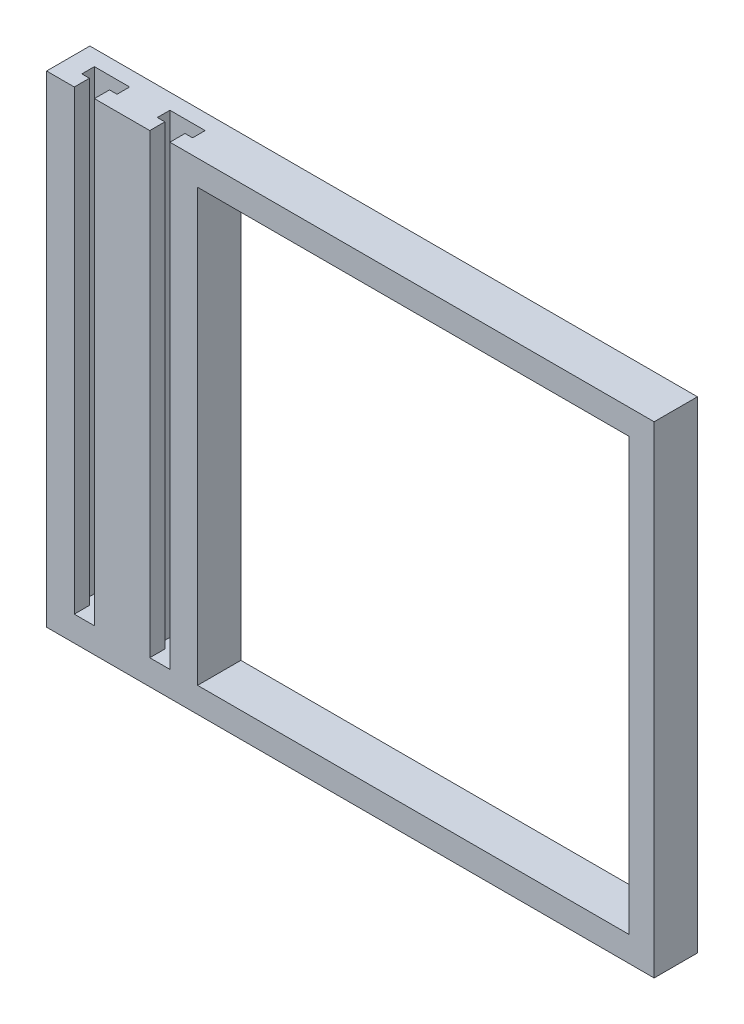
ISO-10303-21;
HEADER;
FILE_DESCRIPTION(('STEP AP214'),'2;1');
FILE_NAME('part.step','',(''),(''),'','','');
FILE_SCHEMA(('AUTOMOTIVE_DESIGN { 1 0 10303 214 1 1 1 1 }'));
ENDSEC;
DATA;
#1=APPLICATION_CONTEXT('core data for automotive mechanical design processes');
#2=APPLICATION_PROTOCOL_DEFINITION('international standard','automotive_design',2000,#1);
#3=PRODUCT_CONTEXT('',#1,'mechanical');
#4=PRODUCT('Part','Part','',(#3));
#5=PRODUCT_RELATED_PRODUCT_CATEGORY('part','',(#4));
#6=PRODUCT_DEFINITION_FORMATION('','',#4);
#7=PRODUCT_DEFINITION_CONTEXT('part definition',#1,'design');
#8=PRODUCT_DEFINITION('design','',#6,#7);
#9=PRODUCT_DEFINITION_SHAPE('','',#8);
#10=(LENGTH_UNIT() NAMED_UNIT(*) SI_UNIT(.MILLI.,.METRE.));
#11=(NAMED_UNIT(*) PLANE_ANGLE_UNIT() SI_UNIT($,.RADIAN.));
#12=(NAMED_UNIT(*) SI_UNIT($,.STERADIAN.) SOLID_ANGLE_UNIT());
#13=UNCERTAINTY_MEASURE_WITH_UNIT(LENGTH_MEASURE(1.E-05),#10,'distance_accuracy_value','');
#14=(GEOMETRIC_REPRESENTATION_CONTEXT(3) GLOBAL_UNCERTAINTY_ASSIGNED_CONTEXT((#13)) GLOBAL_UNIT_ASSIGNED_CONTEXT((#10,
#11,#12)) REPRESENTATION_CONTEXT('',''));
#15=CARTESIAN_POINT('',(0.,0.,0.));
#16=DIRECTION('',(0.,0.,1.));
#17=DIRECTION('',(1.,0.,0.));
#18=AXIS2_PLACEMENT_3D('',#15,#16,#17);
#19=CARTESIAN_POINT('',(0.,0.,8.6));
#20=DIRECTION('',(0.,0.,-1.));
#21=DIRECTION('',(-1.,0.,0.));
#22=AXIS2_PLACEMENT_3D('',#19,#20,#21);
#23=PLANE('',#22);
#24=DIRECTION('',(-1.,0.,0.));
#25=VECTOR('',#24,1.);
#26=CARTESIAN_POINT('',(-47.85,47.85,8.6));
#27=LINE('',#26,#25);
#28=CARTESIAN_POINT('',(-52.35,47.85,8.6));
#29=VERTEX_POINT('',#28);
#30=CARTESIAN_POINT('',(-63.35,47.85,8.6));
#31=VERTEX_POINT('',#30);
#32=EDGE_CURVE('E362',#29,#31,#27,.T.);
#33=ORIENTED_EDGE('',*,*,#32,.T.);
#34=DIRECTION('',(0.,1.,0.));
#35=VECTOR('',#34,1.);
#36=CARTESIAN_POINT('',(-63.35,-51.7522469073824,8.6));
#37=LINE('',#36,#35);
#38=CARTESIAN_POINT('',(-63.35,-42.85,8.6));
#39=VERTEX_POINT('',#38);
#40=EDGE_CURVE('E247',#39,#31,#37,.T.);
#41=ORIENTED_EDGE('',*,*,#40,.F.);
#42=DIRECTION('',(-1.,0.,0.));
#43=VECTOR('',#42,1.);
#44=CARTESIAN_POINT('',(-67.35,-42.85,8.6));
#45=LINE('',#44,#43);
#46=CARTESIAN_POINT('',(-67.35,-42.85,8.6));
#47=VERTEX_POINT('',#46);
#48=EDGE_CURVE('E401',#39,#47,#45,.T.);
#49=ORIENTED_EDGE('',*,*,#48,.T.);
#50=DIRECTION('',(0.,1.,0.));
#51=VECTOR('',#50,1.);
#52=CARTESIAN_POINT('',(-67.35,-51.7522469073824,8.6));
#53=LINE('',#52,#51);
#54=CARTESIAN_POINT('',(-67.35,47.85,8.6));
#55=VERTEX_POINT('',#54);
#56=EDGE_CURVE('E249',#47,#55,#53,.T.);
#57=ORIENTED_EDGE('',*,*,#56,.T.);
#58=CARTESIAN_POINT('',(-72.85,47.85,8.6));
#59=VERTEX_POINT('',#58);
#60=EDGE_CURVE('E358',#55,#59,#27,.T.);
#61=ORIENTED_EDGE('',*,*,#60,.T.);
#62=DIRECTION('',(0.,1.,0.));
#63=VECTOR('',#62,1.);
#64=CARTESIAN_POINT('',(-72.85,47.85,8.6));
#65=LINE('',#64,#63);
#66=CARTESIAN_POINT('',(-72.85,-47.85,8.6));
#67=VERTEX_POINT('',#66);
#68=EDGE_CURVE('E315',#67,#59,#65,.T.);
#69=ORIENTED_EDGE('',*,*,#68,.F.);
#70=DIRECTION('',(1.,0.,0.));
#71=VECTOR('',#70,1.);
#72=CARTESIAN_POINT('',(-47.85,-47.85,8.6));
#73=LINE('',#72,#71);
#74=CARTESIAN_POINT('',(47.85,-47.85,8.6));
#75=VERTEX_POINT('',#74);
#76=EDGE_CURVE('E353',#67,#75,#73,.T.);
#77=ORIENTED_EDGE('',*,*,#76,.T.);
#78=DIRECTION('',(0.,1.,0.));
#79=VECTOR('',#78,1.);
#80=CARTESIAN_POINT('',(47.85,-47.85,8.6));
#81=LINE('',#80,#79);
#82=CARTESIAN_POINT('',(47.85,47.85,8.6));
#83=VERTEX_POINT('',#82);
#84=EDGE_CURVE('E355',#75,#83,#81,.T.);
#85=ORIENTED_EDGE('',*,*,#84,.T.);
#86=CARTESIAN_POINT('',(-48.35,47.85,8.6));
#87=VERTEX_POINT('',#86);
#88=EDGE_CURVE('E359',#83,#87,#27,.T.);
#89=ORIENTED_EDGE('',*,*,#88,.T.);
#90=DIRECTION('',(0.,1.,0.));
#91=VECTOR('',#90,1.);
#92=CARTESIAN_POINT('',(-48.35,-51.7522469073824,8.6));
#93=LINE('',#92,#91);
#94=CARTESIAN_POINT('',(-48.35,-42.85,8.6));
#95=VERTEX_POINT('',#94);
#96=EDGE_CURVE('E303',#95,#87,#93,.T.);
#97=ORIENTED_EDGE('',*,*,#96,.F.);
#98=DIRECTION('',(-1.,0.,0.));
#99=VECTOR('',#98,1.);
#100=CARTESIAN_POINT('',(-48.35,-42.85,8.6));
#101=LINE('',#100,#99);
#102=CARTESIAN_POINT('',(-52.35,-42.85,8.6));
#103=VERTEX_POINT('',#102);
#104=EDGE_CURVE('E258',#95,#103,#101,.T.);
#105=ORIENTED_EDGE('',*,*,#104,.T.);
#106=DIRECTION('',(0.,1.,0.));
#107=VECTOR('',#106,1.);
#108=CARTESIAN_POINT('',(-52.35,-51.7522469073824,8.6));
#109=LINE('',#108,#107);
#110=EDGE_CURVE('E305',#103,#29,#109,.T.);
#111=ORIENTED_EDGE('',*,*,#110,.T.);
#112=EDGE_LOOP('',(#33,#41,#49,#57,#61,#69,#77,#85,#89,#97,#105,#111));
#113=FACE_BOUND('',#112,.T.);
#114=DIRECTION('',(0.,1.,0.));
#115=VECTOR('',#114,1.);
#116=CARTESIAN_POINT('',(42.85,-42.85,8.6));
#117=LINE('',#116,#115);
#118=CARTESIAN_POINT('',(42.85,-42.85,8.6));
#119=VERTEX_POINT('',#118);
#120=CARTESIAN_POINT('',(42.85,42.85,8.6));
#121=VERTEX_POINT('',#120);
#122=EDGE_CURVE('E322',#119,#121,#117,.T.);
#123=ORIENTED_EDGE('',*,*,#122,.F.);
#124=DIRECTION('',(1.,0.,0.));
#125=VECTOR('',#124,1.);
#126=CARTESIAN_POINT('',(-42.85,-42.85,8.6));
#127=LINE('',#126,#125);
#128=CARTESIAN_POINT('',(-42.85,-42.85,8.6));
#129=VERTEX_POINT('',#128);
#130=EDGE_CURVE('E330',#129,#119,#127,.T.);
#131=ORIENTED_EDGE('',*,*,#130,.F.);
#132=DIRECTION('',(0.,-1.,0.));
#133=VECTOR('',#132,1.);
#134=CARTESIAN_POINT('',(-42.85,-42.85,8.6));
#135=LINE('',#134,#133);
#136=CARTESIAN_POINT('',(-42.85,42.85,8.6));
#137=VERTEX_POINT('',#136);
#138=EDGE_CURVE('E327',#137,#129,#135,.T.);
#139=ORIENTED_EDGE('',*,*,#138,.F.);
#140=DIRECTION('',(-1.,0.,0.));
#141=VECTOR('',#140,1.);
#142=CARTESIAN_POINT('',(-42.85,42.85,8.6));
#143=LINE('',#142,#141);
#144=EDGE_CURVE('E324',#121,#137,#143,.T.);
#145=ORIENTED_EDGE('',*,*,#144,.F.);
#146=EDGE_LOOP('',(#123,#131,#139,#145));
#147=FACE_BOUND('',#146,.T.);
#148=ADVANCED_FACE('F42',(#113,#147),#23,.F.);
#149=CARTESIAN_POINT('',(0.,0.,0.));
#150=DIRECTION('',(0.,0.,-1.));
#151=DIRECTION('',(-1.,0.,0.));
#152=AXIS2_PLACEMENT_3D('',#149,#150,#151);
#153=PLANE('',#152);
#154=DIRECTION('',(1.,0.,0.));
#155=VECTOR('',#154,1.);
#156=CARTESIAN_POINT('',(-47.85,-47.85,0.));
#157=LINE('',#156,#155);
#158=CARTESIAN_POINT('',(-72.85,-47.85,0.));
#159=VERTEX_POINT('',#158);
#160=CARTESIAN_POINT('',(47.85,-47.85,0.));
#161=VERTEX_POINT('',#160);
#162=EDGE_CURVE('E352',#159,#161,#157,.T.);
#163=ORIENTED_EDGE('',*,*,#162,.F.);
#164=DIRECTION('',(0.,-1.,0.));
#165=VECTOR('',#164,1.);
#166=CARTESIAN_POINT('',(-72.85,47.85,0.));
#167=LINE('',#166,#165);
#168=CARTESIAN_POINT('',(-72.85,47.85,0.));
#169=VERTEX_POINT('',#168);
#170=EDGE_CURVE('E256',#169,#159,#167,.T.);
#171=ORIENTED_EDGE('',*,*,#170,.F.);
#172=DIRECTION('',(-1.,0.,0.));
#173=VECTOR('',#172,1.);
#174=CARTESIAN_POINT('',(-47.85,47.85,0.));
#175=LINE('',#174,#173);
#176=CARTESIAN_POINT('',(47.85,47.85,0.));
#177=VERTEX_POINT('',#176);
#178=EDGE_CURVE('E356',#177,#169,#175,.T.);
#179=ORIENTED_EDGE('',*,*,#178,.F.);
#180=DIRECTION('',(0.,1.,0.));
#181=VECTOR('',#180,1.);
#182=CARTESIAN_POINT('',(47.85,-47.85,0.));
#183=LINE('',#182,#181);
#184=EDGE_CURVE('E364',#161,#177,#183,.T.);
#185=ORIENTED_EDGE('',*,*,#184,.F.);
#186=EDGE_LOOP('',(#163,#171,#179,#185));
#187=FACE_BOUND('',#186,.T.);
#188=DIRECTION('',(1.,0.,0.));
#189=VECTOR('',#188,1.);
#190=CARTESIAN_POINT('',(-42.85,-42.85,0.));
#191=LINE('',#190,#189);
#192=CARTESIAN_POINT('',(-42.85,-42.85,0.));
#193=VERTEX_POINT('',#192);
#194=CARTESIAN_POINT('',(42.85,-42.85,0.));
#195=VERTEX_POINT('',#194);
#196=EDGE_CURVE('E325',#193,#195,#191,.T.);
#197=ORIENTED_EDGE('',*,*,#196,.T.);
#198=DIRECTION('',(0.,1.,0.));
#199=VECTOR('',#198,1.);
#200=CARTESIAN_POINT('',(42.85,-42.85,0.));
#201=LINE('',#200,#199);
#202=CARTESIAN_POINT('',(42.85,42.85,0.));
#203=VERTEX_POINT('',#202);
#204=EDGE_CURVE('E321',#195,#203,#201,.T.);
#205=ORIENTED_EDGE('',*,*,#204,.T.);
#206=DIRECTION('',(-1.,0.,0.));
#207=VECTOR('',#206,1.);
#208=CARTESIAN_POINT('',(-42.85,42.85,0.));
#209=LINE('',#208,#207);
#210=CARTESIAN_POINT('',(-42.85,42.85,0.));
#211=VERTEX_POINT('',#210);
#212=EDGE_CURVE('E335',#203,#211,#209,.T.);
#213=ORIENTED_EDGE('',*,*,#212,.T.);
#214=DIRECTION('',(0.,-1.,0.));
#215=VECTOR('',#214,1.);
#216=CARTESIAN_POINT('',(-42.85,-42.85,0.));
#217=LINE('',#216,#215);
#218=EDGE_CURVE('E338',#211,#193,#217,.T.);
#219=ORIENTED_EDGE('',*,*,#218,.T.);
#220=EDGE_LOOP('',(#197,#205,#213,#219));
#221=FACE_BOUND('',#220,.T.);
#222=ADVANCED_FACE('F377',(#187,#221),#153,.T.);
#223=CARTESIAN_POINT('',(-47.85,-47.85,8.6));
#224=DIRECTION('',(0.,1.,0.));
#225=DIRECTION('',(0.,0.,1.));
#226=AXIS2_PLACEMENT_3D('',#223,#224,#225);
#227=PLANE('',#226);
#228=ORIENTED_EDGE('',*,*,#162,.T.);
#229=DIRECTION('',(0.,0.,-1.));
#230=VECTOR('',#229,1.);
#231=CARTESIAN_POINT('',(47.85,-47.85,8.6));
#232=LINE('',#231,#230);
#233=EDGE_CURVE('E11',#75,#161,#232,.T.);
#234=ORIENTED_EDGE('',*,*,#233,.F.);
#235=ORIENTED_EDGE('',*,*,#76,.F.);
#236=DIRECTION('',(0.,0.,1.));
#237=VECTOR('',#236,1.);
#238=CARTESIAN_POINT('',(-72.85,-47.85,0.));
#239=LINE('',#238,#237);
#240=EDGE_CURVE('E312',#159,#67,#239,.T.);
#241=ORIENTED_EDGE('',*,*,#240,.F.);
#242=EDGE_LOOP('',(#228,#234,#235,#241));
#243=FACE_BOUND('',#242,.T.);
#244=ADVANCED_FACE('F44',(#243),#227,.F.);
#245=CARTESIAN_POINT('',(47.85,-47.85,8.6));
#246=DIRECTION('',(-1.,0.,0.));
#247=DIRECTION('',(0.,-1.,0.));
#248=AXIS2_PLACEMENT_3D('',#245,#246,#247);
#249=PLANE('',#248);
#250=ORIENTED_EDGE('',*,*,#184,.T.);
#251=DIRECTION('',(0.,0.,-1.));
#252=VECTOR('',#251,1.);
#253=CARTESIAN_POINT('',(47.85,47.85,8.6));
#254=LINE('',#253,#252);
#255=EDGE_CURVE('E50',#83,#177,#254,.T.);
#256=ORIENTED_EDGE('',*,*,#255,.F.);
#257=ORIENTED_EDGE('',*,*,#84,.F.);
#258=ORIENTED_EDGE('',*,*,#233,.T.);
#259=EDGE_LOOP('',(#250,#256,#257,#258));
#260=FACE_BOUND('',#259,.T.);
#261=ADVANCED_FACE('F443',(#260),#249,.F.);
#262=CARTESIAN_POINT('',(-47.85,47.85,8.6));
#263=DIRECTION('',(0.,-1.,0.));
#264=DIRECTION('',(1.,0.,0.));
#265=AXIS2_PLACEMENT_3D('',#262,#263,#264);
#266=PLANE('',#265);
#267=DIRECTION('',(1.,0.,0.));
#268=VECTOR('',#267,1.);
#269=CARTESIAN_POINT('',(-63.35,47.85,5.6));
#270=LINE('',#269,#268);
#271=CARTESIAN_POINT('',(-63.35,47.85,5.6));
#272=VERTEX_POINT('',#271);
#273=CARTESIAN_POINT('',(-61.85,47.85,5.6));
#274=VERTEX_POINT('',#273);
#275=EDGE_CURVE('E235',#272,#274,#270,.T.);
#276=ORIENTED_EDGE('',*,*,#275,.F.);
#277=DIRECTION('',(0.,0.,-1.));
#278=VECTOR('',#277,1.);
#279=CARTESIAN_POINT('',(-63.35,47.85,8.6));
#280=LINE('',#279,#278);
#281=EDGE_CURVE('E229',#31,#272,#280,.T.);
#282=ORIENTED_EDGE('',*,*,#281,.F.);
#283=ORIENTED_EDGE('',*,*,#32,.F.);
#284=DIRECTION('',(0.,0.,1.));
#285=VECTOR('',#284,1.);
#286=CARTESIAN_POINT('',(-52.35,47.85,8.6));
#287=LINE('',#286,#285);
#288=CARTESIAN_POINT('',(-52.35,47.85,5.6));
#289=VERTEX_POINT('',#288);
#290=EDGE_CURVE('E276',#289,#29,#287,.T.);
#291=ORIENTED_EDGE('',*,*,#290,.F.);
#292=DIRECTION('',(1.,0.,0.));
#293=VECTOR('',#292,1.);
#294=CARTESIAN_POINT('',(-52.35,47.85,5.6));
#295=LINE('',#294,#293);
#296=CARTESIAN_POINT('',(-53.85,47.85,5.6));
#297=VERTEX_POINT('',#296);
#298=EDGE_CURVE('E65',#297,#289,#295,.T.);
#299=ORIENTED_EDGE('',*,*,#298,.F.);
#300=DIRECTION('',(0.,0.,1.));
#301=VECTOR('',#300,1.);
#302=CARTESIAN_POINT('',(-53.85,47.85,5.6));
#303=LINE('',#302,#301);
#304=CARTESIAN_POINT('',(-53.85,47.85,3.1));
#305=VERTEX_POINT('',#304);
#306=EDGE_CURVE('E290',#305,#297,#303,.T.);
#307=ORIENTED_EDGE('',*,*,#306,.F.);
#308=DIRECTION('',(-1.,0.,0.));
#309=VECTOR('',#308,1.);
#310=CARTESIAN_POINT('',(-53.85,47.85,3.1));
#311=LINE('',#310,#309);
#312=CARTESIAN_POINT('',(-46.85,47.85,3.1));
#313=VERTEX_POINT('',#312);
#314=EDGE_CURVE('E287',#313,#305,#311,.T.);
#315=ORIENTED_EDGE('',*,*,#314,.F.);
#316=DIRECTION('',(0.,0.,-1.));
#317=VECTOR('',#316,1.);
#318=CARTESIAN_POINT('',(-46.85,47.85,5.6));
#319=LINE('',#318,#317);
#320=CARTESIAN_POINT('',(-46.85,47.85,5.6));
#321=VERTEX_POINT('',#320);
#322=EDGE_CURVE('E284',#321,#313,#319,.T.);
#323=ORIENTED_EDGE('',*,*,#322,.F.);
#324=DIRECTION('',(1.,0.,0.));
#325=VECTOR('',#324,1.);
#326=CARTESIAN_POINT('',(-48.35,47.85,5.6));
#327=LINE('',#326,#325);
#328=CARTESIAN_POINT('',(-48.35,47.85,5.6));
#329=VERTEX_POINT('',#328);
#330=EDGE_CURVE('E281',#329,#321,#327,.T.);
#331=ORIENTED_EDGE('',*,*,#330,.F.);
#332=DIRECTION('',(0.,0.,-1.));
#333=VECTOR('',#332,1.);
#334=CARTESIAN_POINT('',(-48.35,47.85,8.6));
#335=LINE('',#334,#333);
#336=EDGE_CURVE('E278',#87,#329,#335,.T.);
#337=ORIENTED_EDGE('',*,*,#336,.F.);
#338=ORIENTED_EDGE('',*,*,#88,.F.);
#339=ORIENTED_EDGE('',*,*,#255,.T.);
#340=ORIENTED_EDGE('',*,*,#178,.T.);
#341=DIRECTION('',(0.,0.,-1.));
#342=VECTOR('',#341,1.);
#343=CARTESIAN_POINT('',(-72.85,47.85,0.));
#344=LINE('',#343,#342);
#345=EDGE_CURVE('E318',#59,#169,#344,.T.);
#346=ORIENTED_EDGE('',*,*,#345,.F.);
#347=ORIENTED_EDGE('',*,*,#60,.F.);
#348=DIRECTION('',(0.,0.,1.));
#349=VECTOR('',#348,1.);
#350=CARTESIAN_POINT('',(-67.35,47.85,8.6));
#351=LINE('',#350,#349);
#352=CARTESIAN_POINT('',(-67.35,47.85,5.6));
#353=VERTEX_POINT('',#352);
#354=EDGE_CURVE('E227',#353,#55,#351,.T.);
#355=ORIENTED_EDGE('',*,*,#354,.F.);
#356=DIRECTION('',(1.,0.,0.));
#357=VECTOR('',#356,1.);
#358=CARTESIAN_POINT('',(-67.35,47.85,5.6));
#359=LINE('',#358,#357);
#360=CARTESIAN_POINT('',(-68.85,47.85,5.6));
#361=VERTEX_POINT('',#360);
#362=EDGE_CURVE('E210',#361,#353,#359,.T.);
#363=ORIENTED_EDGE('',*,*,#362,.F.);
#364=DIRECTION('',(0.,0.,1.));
#365=VECTOR('',#364,1.);
#366=CARTESIAN_POINT('',(-68.85,47.85,5.6));
#367=LINE('',#366,#365);
#368=CARTESIAN_POINT('',(-68.85,47.85,3.1));
#369=VERTEX_POINT('',#368);
#370=EDGE_CURVE('E220',#369,#361,#367,.T.);
#371=ORIENTED_EDGE('',*,*,#370,.F.);
#372=DIRECTION('',(-1.,0.,0.));
#373=VECTOR('',#372,1.);
#374=CARTESIAN_POINT('',(-61.85,47.85,3.1));
#375=LINE('',#374,#373);
#376=CARTESIAN_POINT('',(-61.85,47.85,3.1));
#377=VERTEX_POINT('',#376);
#378=EDGE_CURVE('E57',#377,#369,#375,.T.);
#379=ORIENTED_EDGE('',*,*,#378,.F.);
#380=DIRECTION('',(0.,0.,-1.));
#381=VECTOR('',#380,1.);
#382=CARTESIAN_POINT('',(-61.85,47.85,5.6));
#383=LINE('',#382,#381);
#384=EDGE_CURVE('E238',#274,#377,#383,.T.);
#385=ORIENTED_EDGE('',*,*,#384,.F.);
#386=EDGE_LOOP('',(#276,#282,#283,#291,#299,#307,#315,#323,#331,#337,#338,#339,#340,#346,#347,
#355,#363,#371,#379,#385));
#387=FACE_BOUND('',#386,.T.);
#388=ADVANCED_FACE('F225',(#387),#266,.F.);
#389=CARTESIAN_POINT('',(42.85,-42.85,8.6));
#390=DIRECTION('',(-1.,0.,0.));
#391=DIRECTION('',(0.,0.,1.));
#392=AXIS2_PLACEMENT_3D('',#389,#390,#391);
#393=PLANE('',#392);
#394=ORIENTED_EDGE('',*,*,#204,.F.);
#395=DIRECTION('',(0.,0.,-1.));
#396=VECTOR('',#395,1.);
#397=CARTESIAN_POINT('',(42.85,-42.85,8.6));
#398=LINE('',#397,#396);
#399=EDGE_CURVE('E332',#119,#195,#398,.T.);
#400=ORIENTED_EDGE('',*,*,#399,.F.);
#401=ORIENTED_EDGE('',*,*,#122,.T.);
#402=DIRECTION('',(0.,0.,-1.));
#403=VECTOR('',#402,1.);
#404=CARTESIAN_POINT('',(42.85,42.85,8.6));
#405=LINE('',#404,#403);
#406=EDGE_CURVE('E349',#121,#203,#405,.T.);
#407=ORIENTED_EDGE('',*,*,#406,.T.);
#408=EDGE_LOOP('',(#394,#400,#401,#407));
#409=FACE_BOUND('',#408,.T.);
#410=ADVANCED_FACE('F440',(#409),#393,.T.);
#411=CARTESIAN_POINT('',(-42.85,42.85,8.6));
#412=DIRECTION('',(0.,-1.,0.));
#413=DIRECTION('',(0.,0.,-1.));
#414=AXIS2_PLACEMENT_3D('',#411,#412,#413);
#415=PLANE('',#414);
#416=ORIENTED_EDGE('',*,*,#212,.F.);
#417=ORIENTED_EDGE('',*,*,#406,.F.);
#418=ORIENTED_EDGE('',*,*,#144,.T.);
#419=DIRECTION('',(0.,0.,-1.));
#420=VECTOR('',#419,1.);
#421=CARTESIAN_POINT('',(-42.85,42.85,8.6));
#422=LINE('',#421,#420);
#423=EDGE_CURVE('E347',#137,#211,#422,.T.);
#424=ORIENTED_EDGE('',*,*,#423,.T.);
#425=EDGE_LOOP('',(#416,#417,#418,#424));
#426=FACE_BOUND('',#425,.T.);
#427=ADVANCED_FACE('F508',(#426),#415,.T.);
#428=CARTESIAN_POINT('',(-42.85,-42.85,8.6));
#429=DIRECTION('',(1.,0.,0.));
#430=DIRECTION('',(0.,0.,-1.));
#431=AXIS2_PLACEMENT_3D('',#428,#429,#430);
#432=PLANE('',#431);
#433=ORIENTED_EDGE('',*,*,#218,.F.);
#434=ORIENTED_EDGE('',*,*,#423,.F.);
#435=ORIENTED_EDGE('',*,*,#138,.T.);
#436=DIRECTION('',(0.,0.,-1.));
#437=VECTOR('',#436,1.);
#438=CARTESIAN_POINT('',(-42.85,-42.85,8.6));
#439=LINE('',#438,#437);
#440=EDGE_CURVE('E345',#129,#193,#439,.T.);
#441=ORIENTED_EDGE('',*,*,#440,.T.);
#442=EDGE_LOOP('',(#433,#434,#435,#441));
#443=FACE_BOUND('',#442,.T.);
#444=ADVANCED_FACE('F505',(#443),#432,.T.);
#445=CARTESIAN_POINT('',(-42.85,-42.85,8.6));
#446=DIRECTION('',(0.,1.,0.));
#447=DIRECTION('',(0.,0.,1.));
#448=AXIS2_PLACEMENT_3D('',#445,#446,#447);
#449=PLANE('',#448);
#450=ORIENTED_EDGE('',*,*,#196,.F.);
#451=ORIENTED_EDGE('',*,*,#440,.F.);
#452=ORIENTED_EDGE('',*,*,#130,.T.);
#453=ORIENTED_EDGE('',*,*,#399,.T.);
#454=EDGE_LOOP('',(#450,#451,#452,#453));
#455=FACE_BOUND('',#454,.T.);
#456=ADVANCED_FACE('F502',(#455),#449,.T.);
#457=CARTESIAN_POINT('',(-72.85,0.,0.));
#458=DIRECTION('',(-1.,0.,0.));
#459=DIRECTION('',(0.,0.,1.));
#460=AXIS2_PLACEMENT_3D('',#457,#458,#459);
#461=PLANE('',#460);
#462=ORIENTED_EDGE('',*,*,#170,.T.);
#463=ORIENTED_EDGE('',*,*,#240,.T.);
#464=ORIENTED_EDGE('',*,*,#68,.T.);
#465=ORIENTED_EDGE('',*,*,#345,.T.);
#466=EDGE_LOOP('',(#462,#463,#464,#465));
#467=FACE_BOUND('',#466,.T.);
#468=ADVANCED_FACE('F381',(#467),#461,.T.);
#469=CARTESIAN_POINT('',(-52.35,-51.7522469073824,5.6));
#470=DIRECTION('',(0.,0.,1.));
#471=DIRECTION('',(1.,0.,0.));
#472=AXIS2_PLACEMENT_3D('',#469,#470,#471);
#473=PLANE('',#472);
#474=DIRECTION('',(-1.,0.,0.));
#475=VECTOR('',#474,1.);
#476=CARTESIAN_POINT('',(-52.35,-42.85,5.6));
#477=LINE('',#476,#475);
#478=CARTESIAN_POINT('',(-52.35,-42.85,5.6));
#479=VERTEX_POINT('',#478);
#480=CARTESIAN_POINT('',(-53.85,-42.85,5.6));
#481=VERTEX_POINT('',#480);
#482=EDGE_CURVE('E272',#479,#481,#477,.T.);
#483=ORIENTED_EDGE('',*,*,#482,.T.);
#484=DIRECTION('',(0.,1.,0.));
#485=VECTOR('',#484,1.);
#486=CARTESIAN_POINT('',(-53.85,-51.7522469073824,5.6));
#487=LINE('',#486,#485);
#488=EDGE_CURVE('E262',#481,#297,#487,.T.);
#489=ORIENTED_EDGE('',*,*,#488,.T.);
#490=ORIENTED_EDGE('',*,*,#298,.T.);
#491=DIRECTION('',(0.,1.,0.));
#492=VECTOR('',#491,1.);
#493=CARTESIAN_POINT('',(-52.35,-51.7522469073824,5.6));
#494=LINE('',#493,#492);
#495=EDGE_CURVE('E293',#479,#289,#494,.T.);
#496=ORIENTED_EDGE('',*,*,#495,.F.);
#497=EDGE_LOOP('',(#483,#489,#490,#496));
#498=FACE_BOUND('',#497,.T.);
#499=ADVANCED_FACE('F472',(#498),#473,.F.);
#500=CARTESIAN_POINT('',(-53.85,-51.7522469073824,5.6));
#501=DIRECTION('',(-1.,0.,0.));
#502=DIRECTION('',(0.,0.,1.));
#503=AXIS2_PLACEMENT_3D('',#500,#501,#502);
#504=PLANE('',#503);
#505=DIRECTION('',(0.,0.,-1.));
#506=VECTOR('',#505,1.);
#507=CARTESIAN_POINT('',(-53.85,-42.85,5.6));
#508=LINE('',#507,#506);
#509=CARTESIAN_POINT('',(-53.85,-42.85,3.1));
#510=VERTEX_POINT('',#509);
#511=EDGE_CURVE('E270',#481,#510,#508,.T.);
#512=ORIENTED_EDGE('',*,*,#511,.T.);
#513=DIRECTION('',(0.,1.,0.));
#514=VECTOR('',#513,1.);
#515=CARTESIAN_POINT('',(-53.85,-51.7522469073824,3.1));
#516=LINE('',#515,#514);
#517=EDGE_CURVE('E295',#510,#305,#516,.T.);
#518=ORIENTED_EDGE('',*,*,#517,.T.);
#519=ORIENTED_EDGE('',*,*,#306,.T.);
#520=ORIENTED_EDGE('',*,*,#488,.F.);
#521=EDGE_LOOP('',(#512,#518,#519,#520));
#522=FACE_BOUND('',#521,.T.);
#523=ADVANCED_FACE('F477',(#522),#504,.F.);
#524=CARTESIAN_POINT('',(-53.85,-51.7522469073824,3.1));
#525=DIRECTION('',(0.,0.,-1.));
#526=DIRECTION('',(-1.,0.,0.));
#527=AXIS2_PLACEMENT_3D('',#524,#525,#526);
#528=PLANE('',#527);
#529=DIRECTION('',(1.,0.,0.));
#530=VECTOR('',#529,1.);
#531=CARTESIAN_POINT('',(-53.85,-42.85,3.1));
#532=LINE('',#531,#530);
#533=CARTESIAN_POINT('',(-46.85,-42.85,3.1));
#534=VERTEX_POINT('',#533);
#535=EDGE_CURVE('E268',#510,#534,#532,.T.);
#536=ORIENTED_EDGE('',*,*,#535,.T.);
#537=DIRECTION('',(0.,1.,0.));
#538=VECTOR('',#537,1.);
#539=CARTESIAN_POINT('',(-46.85,-51.7522469073824,3.1));
#540=LINE('',#539,#538);
#541=EDGE_CURVE('E297',#534,#313,#540,.T.);
#542=ORIENTED_EDGE('',*,*,#541,.T.);
#543=ORIENTED_EDGE('',*,*,#314,.T.);
#544=ORIENTED_EDGE('',*,*,#517,.F.);
#545=EDGE_LOOP('',(#536,#542,#543,#544));
#546=FACE_BOUND('',#545,.T.);
#547=ADVANCED_FACE('F480',(#546),#528,.F.);
#548=CARTESIAN_POINT('',(-46.85,-51.7522469073824,5.6));
#549=DIRECTION('',(1.,0.,0.));
#550=DIRECTION('',(0.,0.,-1.));
#551=AXIS2_PLACEMENT_3D('',#548,#549,#550);
#552=PLANE('',#551);
#553=DIRECTION('',(0.,0.,1.));
#554=VECTOR('',#553,1.);
#555=CARTESIAN_POINT('',(-46.85,-42.85,5.6));
#556=LINE('',#555,#554);
#557=CARTESIAN_POINT('',(-46.85,-42.85,5.6));
#558=VERTEX_POINT('',#557);
#559=EDGE_CURVE('E266',#534,#558,#556,.T.);
#560=ORIENTED_EDGE('',*,*,#559,.T.);
#561=DIRECTION('',(0.,1.,0.));
#562=VECTOR('',#561,1.);
#563=CARTESIAN_POINT('',(-46.85,-51.7522469073824,5.6));
#564=LINE('',#563,#562);
#565=EDGE_CURVE('E299',#558,#321,#564,.T.);
#566=ORIENTED_EDGE('',*,*,#565,.T.);
#567=ORIENTED_EDGE('',*,*,#322,.T.);
#568=ORIENTED_EDGE('',*,*,#541,.F.);
#569=EDGE_LOOP('',(#560,#566,#567,#568));
#570=FACE_BOUND('',#569,.T.);
#571=ADVANCED_FACE('F483',(#570),#552,.F.);
#572=CARTESIAN_POINT('',(-48.35,-51.7522469073824,5.6));
#573=DIRECTION('',(0.,0.,1.));
#574=DIRECTION('',(1.,0.,0.));
#575=AXIS2_PLACEMENT_3D('',#572,#573,#574);
#576=PLANE('',#575);
#577=DIRECTION('',(-1.,0.,0.));
#578=VECTOR('',#577,1.);
#579=CARTESIAN_POINT('',(-48.35,-42.85,5.6));
#580=LINE('',#579,#578);
#581=CARTESIAN_POINT('',(-48.35,-42.85,5.6));
#582=VERTEX_POINT('',#581);
#583=EDGE_CURVE('E264',#558,#582,#580,.T.);
#584=ORIENTED_EDGE('',*,*,#583,.T.);
#585=DIRECTION('',(0.,1.,0.));
#586=VECTOR('',#585,1.);
#587=CARTESIAN_POINT('',(-48.35,-51.7522469073824,5.6));
#588=LINE('',#587,#586);
#589=EDGE_CURVE('E301',#582,#329,#588,.T.);
#590=ORIENTED_EDGE('',*,*,#589,.T.);
#591=ORIENTED_EDGE('',*,*,#330,.T.);
#592=ORIENTED_EDGE('',*,*,#565,.F.);
#593=EDGE_LOOP('',(#584,#590,#591,#592));
#594=FACE_BOUND('',#593,.T.);
#595=ADVANCED_FACE('F462',(#594),#576,.F.);
#596=CARTESIAN_POINT('',(-48.35,-51.7522469073824,8.6));
#597=DIRECTION('',(1.,0.,0.));
#598=DIRECTION('',(0.,0.,-1.));
#599=AXIS2_PLACEMENT_3D('',#596,#597,#598);
#600=PLANE('',#599);
#601=DIRECTION('',(0.,0.,1.));
#602=VECTOR('',#601,1.);
#603=CARTESIAN_POINT('',(-48.35,-42.85,8.6));
#604=LINE('',#603,#602);
#605=EDGE_CURVE('E261',#582,#95,#604,.T.);
#606=ORIENTED_EDGE('',*,*,#605,.T.);
#607=ORIENTED_EDGE('',*,*,#96,.T.);
#608=ORIENTED_EDGE('',*,*,#336,.T.);
#609=ORIENTED_EDGE('',*,*,#589,.F.);
#610=EDGE_LOOP('',(#606,#607,#608,#609));
#611=FACE_BOUND('',#610,.T.);
#612=ADVANCED_FACE('F454',(#611),#600,.F.);
#613=CARTESIAN_POINT('',(-52.35,-51.7522469073824,8.6));
#614=DIRECTION('',(-1.,0.,0.));
#615=DIRECTION('',(0.,0.,1.));
#616=AXIS2_PLACEMENT_3D('',#613,#614,#615);
#617=PLANE('',#616);
#618=DIRECTION('',(0.,0.,-1.));
#619=VECTOR('',#618,1.);
#620=CARTESIAN_POINT('',(-52.35,-42.85,8.6));
#621=LINE('',#620,#619);
#622=EDGE_CURVE('E274',#103,#479,#621,.T.);
#623=ORIENTED_EDGE('',*,*,#622,.T.);
#624=ORIENTED_EDGE('',*,*,#495,.T.);
#625=ORIENTED_EDGE('',*,*,#290,.T.);
#626=ORIENTED_EDGE('',*,*,#110,.F.);
#627=EDGE_LOOP('',(#623,#624,#625,#626));
#628=FACE_BOUND('',#627,.T.);
#629=ADVANCED_FACE('F471',(#628),#617,.F.);
#630=CARTESIAN_POINT('',(-42.85,-42.85,8.6));
#631=DIRECTION('',(0.,1.,0.));
#632=DIRECTION('',(0.,0.,1.));
#633=AXIS2_PLACEMENT_3D('',#630,#631,#632);
#634=PLANE('',#633);
#635=ORIENTED_EDGE('',*,*,#482,.F.);
#636=ORIENTED_EDGE('',*,*,#622,.F.);
#637=ORIENTED_EDGE('',*,*,#104,.F.);
#638=ORIENTED_EDGE('',*,*,#605,.F.);
#639=ORIENTED_EDGE('',*,*,#583,.F.);
#640=ORIENTED_EDGE('',*,*,#559,.F.);
#641=ORIENTED_EDGE('',*,*,#535,.F.);
#642=ORIENTED_EDGE('',*,*,#511,.F.);
#643=EDGE_LOOP('',(#635,#636,#637,#638,#639,#640,#641,#642));
#644=FACE_BOUND('',#643,.T.);
#645=ADVANCED_FACE('F467',(#644),#634,.T.);
#646=CARTESIAN_POINT('',(-61.85,-51.7522469073824,3.1));
#647=DIRECTION('',(0.,0.,-1.));
#648=DIRECTION('',(-1.,0.,0.));
#649=AXIS2_PLACEMENT_3D('',#646,#647,#648);
#650=PLANE('',#649);
#651=DIRECTION('',(1.,0.,0.));
#652=VECTOR('',#651,1.);
#653=CARTESIAN_POINT('',(-61.85,-42.85,3.1));
#654=LINE('',#653,#652);
#655=CARTESIAN_POINT('',(-68.85,-42.85,3.1));
#656=VERTEX_POINT('',#655);
#657=CARTESIAN_POINT('',(-61.85,-42.85,3.1));
#658=VERTEX_POINT('',#657);
#659=EDGE_CURVE('E257',#656,#658,#654,.T.);
#660=ORIENTED_EDGE('',*,*,#659,.T.);
#661=DIRECTION('',(0.,1.,0.));
#662=VECTOR('',#661,1.);
#663=CARTESIAN_POINT('',(-61.85,-51.7522469073824,3.1));
#664=LINE('',#663,#662);
#665=EDGE_CURVE('E241',#658,#377,#664,.T.);
#666=ORIENTED_EDGE('',*,*,#665,.T.);
#667=ORIENTED_EDGE('',*,*,#378,.T.);
#668=DIRECTION('',(0.,1.,0.));
#669=VECTOR('',#668,1.);
#670=CARTESIAN_POINT('',(-68.85,-51.7522469073824,3.1));
#671=LINE('',#670,#669);
#672=EDGE_CURVE('E217',#656,#369,#671,.T.);
#673=ORIENTED_EDGE('',*,*,#672,.F.);
#674=EDGE_LOOP('',(#660,#666,#667,#673));
#675=FACE_BOUND('',#674,.T.);
#676=ADVANCED_FACE('F415',(#675),#650,.F.);
#677=CARTESIAN_POINT('',(-61.85,-51.7522469073824,5.6));
#678=DIRECTION('',(1.,0.,0.));
#679=DIRECTION('',(0.,0.,-1.));
#680=AXIS2_PLACEMENT_3D('',#677,#678,#679);
#681=PLANE('',#680);
#682=DIRECTION('',(0.,0.,1.));
#683=VECTOR('',#682,1.);
#684=CARTESIAN_POINT('',(-61.85,-42.85,5.6));
#685=LINE('',#684,#683);
#686=CARTESIAN_POINT('',(-61.85,-42.85,5.6));
#687=VERTEX_POINT('',#686);
#688=EDGE_CURVE('E412',#658,#687,#685,.T.);
#689=ORIENTED_EDGE('',*,*,#688,.T.);
#690=DIRECTION('',(0.,1.,0.));
#691=VECTOR('',#690,1.);
#692=CARTESIAN_POINT('',(-61.85,-51.7522469073824,5.6));
#693=LINE('',#692,#691);
#694=EDGE_CURVE('E243',#687,#274,#693,.T.);
#695=ORIENTED_EDGE('',*,*,#694,.T.);
#696=ORIENTED_EDGE('',*,*,#384,.T.);
#697=ORIENTED_EDGE('',*,*,#665,.F.);
#698=EDGE_LOOP('',(#689,#695,#696,#697));
#699=FACE_BOUND('',#698,.T.);
#700=ADVANCED_FACE('F419',(#699),#681,.F.);
#701=CARTESIAN_POINT('',(-63.35,-51.7522469073824,5.6));
#702=DIRECTION('',(0.,0.,1.));
#703=DIRECTION('',(1.,0.,0.));
#704=AXIS2_PLACEMENT_3D('',#701,#702,#703);
#705=PLANE('',#704);
#706=DIRECTION('',(-1.,0.,0.));
#707=VECTOR('',#706,1.);
#708=CARTESIAN_POINT('',(-63.35,-42.85,5.6));
#709=LINE('',#708,#707);
#710=CARTESIAN_POINT('',(-63.35,-42.85,5.6));
#711=VERTEX_POINT('',#710);
#712=EDGE_CURVE('E400',#687,#711,#709,.T.);
#713=ORIENTED_EDGE('',*,*,#712,.T.);
#714=DIRECTION('',(0.,1.,0.));
#715=VECTOR('',#714,1.);
#716=CARTESIAN_POINT('',(-63.35,-51.7522469073824,5.6));
#717=LINE('',#716,#715);
#718=EDGE_CURVE('E245',#711,#272,#717,.T.);
#719=ORIENTED_EDGE('',*,*,#718,.T.);
#720=ORIENTED_EDGE('',*,*,#275,.T.);
#721=ORIENTED_EDGE('',*,*,#694,.F.);
#722=EDGE_LOOP('',(#713,#719,#720,#721));
#723=FACE_BOUND('',#722,.T.);
#724=ADVANCED_FACE('F421',(#723),#705,.F.);
#725=CARTESIAN_POINT('',(-63.35,-51.7522469073824,8.6));
#726=DIRECTION('',(1.,0.,0.));
#727=DIRECTION('',(0.,0.,-1.));
#728=AXIS2_PLACEMENT_3D('',#725,#726,#727);
#729=PLANE('',#728);
#730=DIRECTION('',(0.,0.,1.));
#731=VECTOR('',#730,1.);
#732=CARTESIAN_POINT('',(-63.35,-42.85,8.6));
#733=LINE('',#732,#731);
#734=EDGE_CURVE('E396',#711,#39,#733,.T.);
#735=ORIENTED_EDGE('',*,*,#734,.T.);
#736=ORIENTED_EDGE('',*,*,#40,.T.);
#737=ORIENTED_EDGE('',*,*,#281,.T.);
#738=ORIENTED_EDGE('',*,*,#718,.F.);
#739=EDGE_LOOP('',(#735,#736,#737,#738));
#740=FACE_BOUND('',#739,.T.);
#741=ADVANCED_FACE('F394',(#740),#729,.F.);
#742=CARTESIAN_POINT('',(-67.35,-51.7522469073824,8.6));
#743=DIRECTION('',(-1.,0.,0.));
#744=DIRECTION('',(0.,0.,1.));
#745=AXIS2_PLACEMENT_3D('',#742,#743,#744);
#746=PLANE('',#745);
#747=DIRECTION('',(0.,0.,-1.));
#748=VECTOR('',#747,1.);
#749=CARTESIAN_POINT('',(-67.35,-42.85,8.6));
#750=LINE('',#749,#748);
#751=CARTESIAN_POINT('',(-67.35,-42.85,5.6));
#752=VERTEX_POINT('',#751);
#753=EDGE_CURVE('E405',#47,#752,#750,.T.);
#754=ORIENTED_EDGE('',*,*,#753,.T.);
#755=DIRECTION('',(0.,1.,0.));
#756=VECTOR('',#755,1.);
#757=CARTESIAN_POINT('',(-67.35,-51.7522469073824,5.6));
#758=LINE('',#757,#756);
#759=EDGE_CURVE('E216',#752,#353,#758,.T.);
#760=ORIENTED_EDGE('',*,*,#759,.T.);
#761=ORIENTED_EDGE('',*,*,#354,.T.);
#762=ORIENTED_EDGE('',*,*,#56,.F.);
#763=EDGE_LOOP('',(#754,#760,#761,#762));
#764=FACE_BOUND('',#763,.T.);
#765=ADVANCED_FACE('F428',(#764),#746,.F.);
#766=CARTESIAN_POINT('',(-67.35,-51.7522469073824,5.6));
#767=DIRECTION('',(0.,0.,1.));
#768=DIRECTION('',(1.,0.,0.));
#769=AXIS2_PLACEMENT_3D('',#766,#767,#768);
#770=PLANE('',#769);
#771=DIRECTION('',(-1.,0.,0.));
#772=VECTOR('',#771,1.);
#773=CARTESIAN_POINT('',(-67.35,-42.85,5.6));
#774=LINE('',#773,#772);
#775=CARTESIAN_POINT('',(-68.85,-42.85,5.6));
#776=VERTEX_POINT('',#775);
#777=EDGE_CURVE('E213',#752,#776,#774,.T.);
#778=ORIENTED_EDGE('',*,*,#777,.T.);
#779=DIRECTION('',(0.,1.,0.));
#780=VECTOR('',#779,1.);
#781=CARTESIAN_POINT('',(-68.85,-51.7522469073824,5.6));
#782=LINE('',#781,#780);
#783=EDGE_CURVE('E205',#776,#361,#782,.T.);
#784=ORIENTED_EDGE('',*,*,#783,.T.);
#785=ORIENTED_EDGE('',*,*,#362,.T.);
#786=ORIENTED_EDGE('',*,*,#759,.F.);
#787=EDGE_LOOP('',(#778,#784,#785,#786));
#788=FACE_BOUND('',#787,.T.);
#789=ADVANCED_FACE('F207',(#788),#770,.F.);
#790=CARTESIAN_POINT('',(-68.85,-51.7522469073824,5.6));
#791=DIRECTION('',(-1.,0.,0.));
#792=DIRECTION('',(0.,0.,1.));
#793=AXIS2_PLACEMENT_3D('',#790,#791,#792);
#794=PLANE('',#793);
#795=DIRECTION('',(0.,0.,-1.));
#796=VECTOR('',#795,1.);
#797=CARTESIAN_POINT('',(-68.85,-42.85,5.6));
#798=LINE('',#797,#796);
#799=EDGE_CURVE('E254',#776,#656,#798,.T.);
#800=ORIENTED_EDGE('',*,*,#799,.T.);
#801=ORIENTED_EDGE('',*,*,#672,.T.);
#802=ORIENTED_EDGE('',*,*,#370,.T.);
#803=ORIENTED_EDGE('',*,*,#783,.F.);
#804=EDGE_LOOP('',(#800,#801,#802,#803));
#805=FACE_BOUND('',#804,.T.);
#806=ADVANCED_FACE('F221',(#805),#794,.F.);
#807=CARTESIAN_POINT('',(-42.85,-42.85,8.6));
#808=DIRECTION('',(0.,1.,0.));
#809=DIRECTION('',(0.,0.,1.));
#810=AXIS2_PLACEMENT_3D('',#807,#808,#809);
#811=PLANE('',#810);
#812=ORIENTED_EDGE('',*,*,#659,.F.);
#813=ORIENTED_EDGE('',*,*,#799,.F.);
#814=ORIENTED_EDGE('',*,*,#777,.F.);
#815=ORIENTED_EDGE('',*,*,#753,.F.);
#816=ORIENTED_EDGE('',*,*,#48,.F.);
#817=ORIENTED_EDGE('',*,*,#734,.F.);
#818=ORIENTED_EDGE('',*,*,#712,.F.);
#819=ORIENTED_EDGE('',*,*,#688,.F.);
#820=EDGE_LOOP('',(#812,#813,#814,#815,#816,#817,#818,#819));
#821=FACE_BOUND('',#820,.T.);
#822=ADVANCED_FACE('F404',(#821),#811,.T.);
#823=CLOSED_SHELL('',(#148,#222,#244,#261,#388,#410,#427,#444,#456,#468,#499,#523,#547,#571,
#595,#612,#629,#645,#676,#700,#724,#741,#765,#789,#806,#822));
#824=MANIFOLD_SOLID_BREP('B2',#823);
#825=ADVANCED_BREP_SHAPE_REPRESENTATION('',(#18,#824),#14);
#826=SHAPE_DEFINITION_REPRESENTATION(#9,#825);
ENDSEC;
END-ISO-10303-21;
